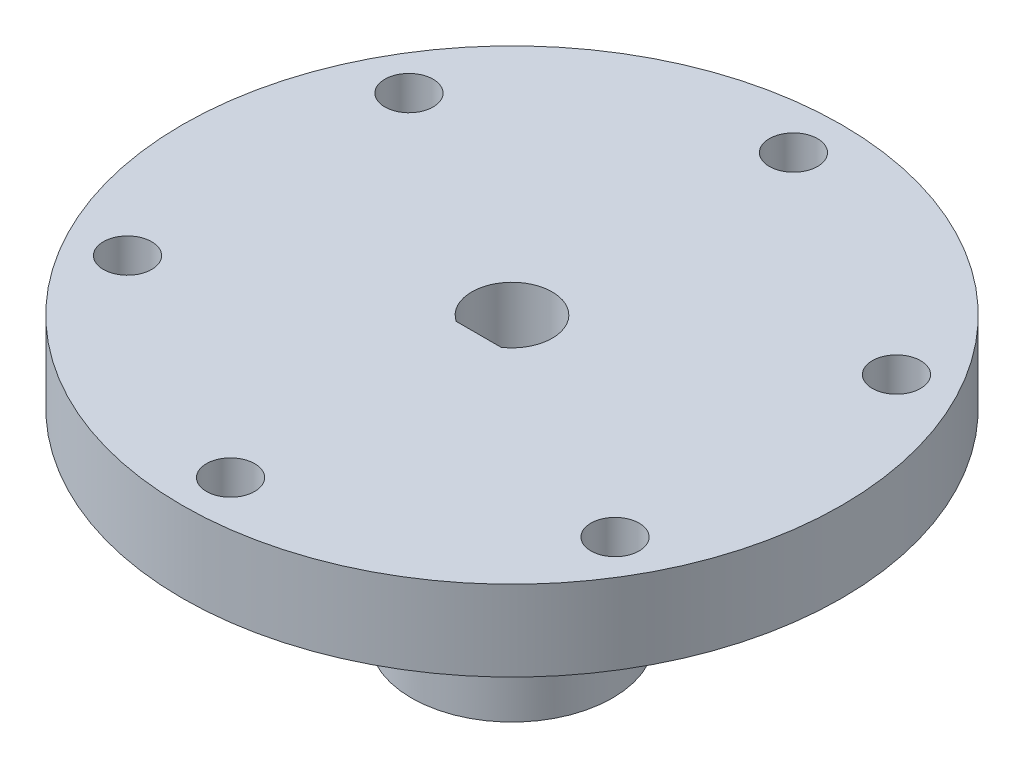
ISO-10303-21;
HEADER;
FILE_DESCRIPTION(('STEP AP214'),'2;1');
FILE_NAME('part.step','',(''),(''),'','','');
FILE_SCHEMA(('AUTOMOTIVE_DESIGN { 1 0 10303 214 1 1 1 1 }'));
ENDSEC;
DATA;
#1=APPLICATION_CONTEXT('core data for automotive mechanical design processes');
#2=APPLICATION_PROTOCOL_DEFINITION('international standard','automotive_design',2000,#1);
#3=PRODUCT_CONTEXT('',#1,'mechanical');
#4=PRODUCT('Part','Part','',(#3));
#5=PRODUCT_RELATED_PRODUCT_CATEGORY('part','',(#4));
#6=PRODUCT_DEFINITION_FORMATION('','',#4);
#7=PRODUCT_DEFINITION_CONTEXT('part definition',#1,'design');
#8=PRODUCT_DEFINITION('design','',#6,#7);
#9=PRODUCT_DEFINITION_SHAPE('','',#8);
#10=(LENGTH_UNIT() NAMED_UNIT(*) SI_UNIT(.MILLI.,.METRE.));
#11=(NAMED_UNIT(*) PLANE_ANGLE_UNIT() SI_UNIT($,.RADIAN.));
#12=(NAMED_UNIT(*) SI_UNIT($,.STERADIAN.) SOLID_ANGLE_UNIT());
#13=UNCERTAINTY_MEASURE_WITH_UNIT(LENGTH_MEASURE(1.E-05),#10,'distance_accuracy_value','');
#14=(GEOMETRIC_REPRESENTATION_CONTEXT(3) GLOBAL_UNCERTAINTY_ASSIGNED_CONTEXT((#13)) GLOBAL_UNIT_ASSIGNED_CONTEXT((#10,
#11,#12)) REPRESENTATION_CONTEXT('',''));
#15=CARTESIAN_POINT('',(0.,0.,0.));
#16=DIRECTION('',(0.,0.,1.));
#17=DIRECTION('',(1.,0.,0.));
#18=AXIS2_PLACEMENT_3D('',#15,#16,#17);
#19=CARTESIAN_POINT('',(0.,35.,0.));
#20=DIRECTION('',(0.,-1.,0.));
#21=DIRECTION('',(0.,0.,-1.));
#22=AXIS2_PLACEMENT_3D('',#19,#20,#21);
#23=CYLINDRICAL_SURFACE('',#22,41.);
#24=CARTESIAN_POINT('',(0.,35.,0.));
#25=DIRECTION('',(0.,1.,0.));
#26=DIRECTION('',(0.,0.,1.));
#27=AXIS2_PLACEMENT_3D('',#24,#25,#26);
#28=CIRCLE('',#27,41.);
#29=CARTESIAN_POINT('',(0.,35.,41.));
#30=VERTEX_POINT('',#29);
#31=EDGE_CURVE('E70',#30,#30,#28,.T.);
#32=ORIENTED_EDGE('',*,*,#31,.F.);
#33=EDGE_LOOP('',(#32));
#34=FACE_BOUND('',#33,.T.);
#35=CARTESIAN_POINT('',(0.,25.,0.));
#36=DIRECTION('',(0.,-1.,0.));
#37=DIRECTION('',(0.,0.,-1.));
#38=AXIS2_PLACEMENT_3D('',#35,#36,#37);
#39=CIRCLE('',#38,41.);
#40=CARTESIAN_POINT('',(0.,25.,-41.));
#41=VERTEX_POINT('',#40);
#42=EDGE_CURVE('E184',#41,#41,#39,.T.);
#43=ORIENTED_EDGE('',*,*,#42,.F.);
#44=EDGE_LOOP('',(#43));
#45=FACE_BOUND('',#44,.T.);
#46=ADVANCED_FACE('F38',(#34,#45),#23,.T.);
#47=CARTESIAN_POINT('',(30.3108891324554,0.,-17.5));
#48=DIRECTION('',(0.,1.,0.));
#49=DIRECTION('',(0.,0.,1.));
#50=AXIS2_PLACEMENT_3D('',#47,#48,#49);
#51=CYLINDRICAL_SURFACE('',#50,3.00000000000009);
#52=CARTESIAN_POINT('',(30.3108891324554,35.,-17.5));
#53=DIRECTION('',(0.,1.,0.));
#54=DIRECTION('',(0.,0.,1.));
#55=AXIS2_PLACEMENT_3D('',#52,#53,#54);
#56=CIRCLE('',#55,3.00000000000009);
#57=CARTESIAN_POINT('',(30.3108891324554,35.,-14.4999999999999));
#58=VERTEX_POINT('',#57);
#59=EDGE_CURVE('E95',#58,#58,#56,.T.);
#60=ORIENTED_EDGE('',*,*,#59,.T.);
#61=EDGE_LOOP('',(#60));
#62=FACE_BOUND('',#61,.T.);
#63=CARTESIAN_POINT('',(30.3108891324554,25.,-17.5));
#64=DIRECTION('',(0.,-1.,0.));
#65=DIRECTION('',(0.,0.,-1.));
#66=AXIS2_PLACEMENT_3D('',#63,#64,#65);
#67=CIRCLE('',#66,3.00000000000009);
#68=CARTESIAN_POINT('',(30.3108891324554,25.,-20.5000000000001));
#69=VERTEX_POINT('',#68);
#70=EDGE_CURVE('E166',#69,#69,#67,.F.);
#71=ORIENTED_EDGE('',*,*,#70,.F.);
#72=EDGE_LOOP('',(#71));
#73=FACE_BOUND('',#72,.T.);
#74=ADVANCED_FACE('F127',(#62,#73),#51,.F.);
#75=CARTESIAN_POINT('',(30.3108891324554,0.,17.5));
#76=DIRECTION('',(0.,1.,0.));
#77=DIRECTION('',(0.,0.,1.));
#78=AXIS2_PLACEMENT_3D('',#75,#76,#77);
#79=CYLINDRICAL_SURFACE('',#78,3.00000000000017);
#80=CARTESIAN_POINT('',(30.3108891324554,35.,17.5));
#81=DIRECTION('',(0.,1.,0.));
#82=DIRECTION('',(0.,0.,1.));
#83=AXIS2_PLACEMENT_3D('',#80,#81,#82);
#84=CIRCLE('',#83,3.00000000000017);
#85=CARTESIAN_POINT('',(30.3108891324554,35.,20.5000000000002));
#86=VERTEX_POINT('',#85);
#87=EDGE_CURVE('E101',#86,#86,#84,.T.);
#88=ORIENTED_EDGE('',*,*,#87,.T.);
#89=EDGE_LOOP('',(#88));
#90=FACE_BOUND('',#89,.T.);
#91=CARTESIAN_POINT('',(30.3108891324554,25.,17.5));
#92=DIRECTION('',(0.,-1.,0.));
#93=DIRECTION('',(0.,0.,-1.));
#94=AXIS2_PLACEMENT_3D('',#91,#92,#93);
#95=CIRCLE('',#94,3.00000000000017);
#96=CARTESIAN_POINT('',(30.3108891324554,25.,14.4999999999998));
#97=VERTEX_POINT('',#96);
#98=EDGE_CURVE('E169',#97,#97,#95,.F.);
#99=ORIENTED_EDGE('',*,*,#98,.F.);
#100=EDGE_LOOP('',(#99));
#101=FACE_BOUND('',#100,.T.);
#102=ADVANCED_FACE('F133',(#90,#101),#79,.F.);
#103=CARTESIAN_POINT('',(0.,0.,35.));
#104=DIRECTION('',(0.,1.,0.));
#105=DIRECTION('',(0.,0.,1.));
#106=AXIS2_PLACEMENT_3D('',#103,#104,#105);
#107=CYLINDRICAL_SURFACE('',#106,3.00000000000024);
#108=CARTESIAN_POINT('',(0.,35.,35.));
#109=DIRECTION('',(0.,1.,0.));
#110=DIRECTION('',(0.,0.,1.));
#111=AXIS2_PLACEMENT_3D('',#108,#109,#110);
#112=CIRCLE('',#111,3.00000000000024);
#113=CARTESIAN_POINT('',(0.,35.,38.0000000000002));
#114=VERTEX_POINT('',#113);
#115=EDGE_CURVE('E104',#114,#114,#112,.T.);
#116=ORIENTED_EDGE('',*,*,#115,.T.);
#117=EDGE_LOOP('',(#116));
#118=FACE_BOUND('',#117,.T.);
#119=CARTESIAN_POINT('',(0.,25.,35.));
#120=DIRECTION('',(0.,-1.,0.));
#121=DIRECTION('',(0.,0.,-1.));
#122=AXIS2_PLACEMENT_3D('',#119,#120,#121);
#123=CIRCLE('',#122,3.00000000000024);
#124=CARTESIAN_POINT('',(0.,25.,31.9999999999998));
#125=VERTEX_POINT('',#124);
#126=EDGE_CURVE('E173',#125,#125,#123,.F.);
#127=ORIENTED_EDGE('',*,*,#126,.F.);
#128=EDGE_LOOP('',(#127));
#129=FACE_BOUND('',#128,.T.);
#130=ADVANCED_FACE('F210',(#118,#129),#107,.F.);
#131=CARTESIAN_POINT('',(-30.3108891324554,0.,17.5));
#132=DIRECTION('',(0.,1.,0.));
#133=DIRECTION('',(0.,0.,1.));
#134=AXIS2_PLACEMENT_3D('',#131,#132,#133);
#135=CYLINDRICAL_SURFACE('',#134,3.00000000000033);
#136=CARTESIAN_POINT('',(-30.3108891324554,35.,17.5));
#137=DIRECTION('',(0.,1.,0.));
#138=DIRECTION('',(0.,0.,1.));
#139=AXIS2_PLACEMENT_3D('',#136,#137,#138);
#140=CIRCLE('',#139,3.00000000000033);
#141=CARTESIAN_POINT('',(-30.3108891324554,35.,20.5000000000003));
#142=VERTEX_POINT('',#141);
#143=EDGE_CURVE('E98',#142,#142,#140,.T.);
#144=ORIENTED_EDGE('',*,*,#143,.T.);
#145=EDGE_LOOP('',(#144));
#146=FACE_BOUND('',#145,.T.);
#147=CARTESIAN_POINT('',(-30.3108891324554,25.,17.5));
#148=DIRECTION('',(0.,-1.,0.));
#149=DIRECTION('',(0.,0.,-1.));
#150=AXIS2_PLACEMENT_3D('',#147,#148,#149);
#151=CIRCLE('',#150,3.00000000000033);
#152=CARTESIAN_POINT('',(-30.3108891324554,25.,14.4999999999997));
#153=VERTEX_POINT('',#152);
#154=EDGE_CURVE('E178',#153,#153,#151,.F.);
#155=ORIENTED_EDGE('',*,*,#154,.F.);
#156=EDGE_LOOP('',(#155));
#157=FACE_BOUND('',#156,.T.);
#158=ADVANCED_FACE('F216',(#146,#157),#135,.F.);
#159=CARTESIAN_POINT('',(-30.3108891324554,0.,-17.5));
#160=DIRECTION('',(0.,1.,0.));
#161=DIRECTION('',(0.,0.,1.));
#162=AXIS2_PLACEMENT_3D('',#159,#160,#161);
#163=CYLINDRICAL_SURFACE('',#162,3.00000000000042);
#164=CARTESIAN_POINT('',(-30.3108891324554,35.,-17.5));
#165=DIRECTION('',(0.,1.,0.));
#166=DIRECTION('',(0.,0.,1.));
#167=AXIS2_PLACEMENT_3D('',#164,#165,#166);
#168=CIRCLE('',#167,3.00000000000042);
#169=CARTESIAN_POINT('',(-30.3108891324554,35.,-14.4999999999996));
#170=VERTEX_POINT('',#169);
#171=EDGE_CURVE('E78',#170,#170,#168,.T.);
#172=ORIENTED_EDGE('',*,*,#171,.T.);
#173=EDGE_LOOP('',(#172));
#174=FACE_BOUND('',#173,.T.);
#175=CARTESIAN_POINT('',(-30.3108891324554,25.,-17.5));
#176=DIRECTION('',(0.,-1.,0.));
#177=DIRECTION('',(0.,0.,-1.));
#178=AXIS2_PLACEMENT_3D('',#175,#176,#177);
#179=CIRCLE('',#178,3.00000000000042);
#180=CARTESIAN_POINT('',(-30.3108891324554,25.,-20.5000000000004));
#181=VERTEX_POINT('',#180);
#182=EDGE_CURVE('E181',#181,#181,#179,.F.);
#183=ORIENTED_EDGE('',*,*,#182,.F.);
#184=EDGE_LOOP('',(#183));
#185=FACE_BOUND('',#184,.T.);
#186=ADVANCED_FACE('F121',(#174,#185),#163,.F.);
#187=CARTESIAN_POINT('',(0.,0.,-35.));
#188=DIRECTION('',(0.,1.,0.));
#189=DIRECTION('',(0.,0.,1.));
#190=AXIS2_PLACEMENT_3D('',#187,#188,#189);
#191=CYLINDRICAL_SURFACE('',#190,3.);
#192=CARTESIAN_POINT('',(0.,35.,-35.));
#193=DIRECTION('',(0.,1.,0.));
#194=DIRECTION('',(0.,0.,1.));
#195=AXIS2_PLACEMENT_3D('',#192,#193,#194);
#196=CIRCLE('',#195,3.);
#197=CARTESIAN_POINT('',(0.,35.,-32.));
#198=VERTEX_POINT('',#197);
#199=EDGE_CURVE('E71',#198,#198,#196,.T.);
#200=ORIENTED_EDGE('',*,*,#199,.T.);
#201=EDGE_LOOP('',(#200));
#202=FACE_BOUND('',#201,.T.);
#203=CARTESIAN_POINT('',(0.,25.,-35.));
#204=DIRECTION('',(0.,-1.,0.));
#205=DIRECTION('',(0.,0.,-1.));
#206=AXIS2_PLACEMENT_3D('',#203,#204,#205);
#207=CIRCLE('',#206,3.);
#208=CARTESIAN_POINT('',(0.,25.,-38.));
#209=VERTEX_POINT('',#208);
#210=EDGE_CURVE('E43',#209,#209,#207,.F.);
#211=ORIENTED_EDGE('',*,*,#210,.F.);
#212=EDGE_LOOP('',(#211));
#213=FACE_BOUND('',#212,.T.);
#214=ADVANCED_FACE('F114',(#202,#213),#191,.F.);
#215=CARTESIAN_POINT('',(0.,0.,0.));
#216=DIRECTION('',(0.,1.,0.));
#217=DIRECTION('',(0.,0.,1.));
#218=AXIS2_PLACEMENT_3D('',#215,#216,#217);
#219=PLANE('',#218);
#220=CARTESIAN_POINT('',(0.,0.,0.));
#221=DIRECTION('',(0.,1.,0.));
#222=DIRECTION('',(0.,0.,1.));
#223=AXIS2_PLACEMENT_3D('',#220,#221,#222);
#224=CIRCLE('',#223,12.5);
#225=CARTESIAN_POINT('',(0.,0.,12.5));
#226=VERTEX_POINT('',#225);
#227=EDGE_CURVE('E11',#226,#226,#224,.T.);
#228=ORIENTED_EDGE('',*,*,#227,.F.);
#229=EDGE_LOOP('',(#228));
#230=FACE_BOUND('',#229,.T.);
#231=CARTESIAN_POINT('',(0.,0.,0.));
#232=DIRECTION('',(0.,1.,0.));
#233=DIRECTION('',(0.,0.,1.));
#234=AXIS2_PLACEMENT_3D('',#231,#232,#233);
#235=CIRCLE('',#234,5.);
#236=CARTESIAN_POINT('',(2.78881695347687,0.,4.15));
#237=VERTEX_POINT('',#236);
#238=CARTESIAN_POINT('',(-2.78881695347687,0.,4.15));
#239=VERTEX_POINT('',#238);
#240=EDGE_CURVE('E48',#237,#239,#235,.T.);
#241=ORIENTED_EDGE('',*,*,#240,.T.);
#242=DIRECTION('',(1.,0.,0.));
#243=VECTOR('',#242,1.);
#244=CARTESIAN_POINT('',(0.,0.,4.15));
#245=LINE('',#244,#243);
#246=EDGE_CURVE('E81',#239,#237,#245,.T.);
#247=ORIENTED_EDGE('',*,*,#246,.T.);
#248=EDGE_LOOP('',(#241,#247));
#249=FACE_BOUND('',#248,.T.);
#250=ADVANCED_FACE('F112',(#230,#249),#219,.F.);
#251=CARTESIAN_POINT('',(0.,15.,0.));
#252=DIRECTION('',(0.,-1.,0.));
#253=DIRECTION('',(0.,0.,-1.));
#254=AXIS2_PLACEMENT_3D('',#251,#252,#253);
#255=CYLINDRICAL_SURFACE('',#254,12.5);
#256=CARTESIAN_POINT('',(-1.5,9.,12.4096736459909));
#257=CARTESIAN_POINT('',(-1.49999641586388,9.08392957059518,12.4096748089167));
#258=CARTESIAN_POINT('',(-1.49293206748169,9.1679122600607,12.4105342894214));
#259=CARTESIAN_POINT('',(-1.46486159354819,9.33354230601578,12.4138782255216));
#260=CARTESIAN_POINT('',(-1.44384072619508,9.41518709784051,12.4163643992983));
#261=CARTESIAN_POINT('',(-1.38848417307918,9.5737192027569,12.4226761552619));
#262=CARTESIAN_POINT('',(-1.35415731394874,9.65060963056811,12.426500849368));
#263=CARTESIAN_POINT('',(-1.27318168778971,9.79752357105048,12.4350576249844));
#264=CARTESIAN_POINT('',(-1.22653510106008,9.86754829578398,12.4397895458966));
#265=CARTESIAN_POINT('',(-1.1219857196502,9.99911988580508,12.4496550027324));
#266=CARTESIAN_POINT('',(-1.06403198625323,10.0606261471743,12.4547902908254));
#267=CARTESIAN_POINT('',(-0.938622932174397,10.1730643590809,12.4648680792729));
#268=CARTESIAN_POINT('',(-0.871167147527071,10.2239957929709,12.4698105701984));
#269=CARTESIAN_POINT('',(-0.728414784233991,10.3139832664681,12.4789637011531));
#270=CARTESIAN_POINT('',(-0.653094976924497,10.3530027078698,12.4831720690333));
#271=CARTESIAN_POINT('',(-0.496912883636391,10.4178242301924,12.4903635621621));
#272=CARTESIAN_POINT('',(-0.416050788042773,10.4436267648739,12.4933467294733));
#273=CARTESIAN_POINT('',(-0.251493928492543,10.4811611280517,12.4977393662263));
#274=CARTESIAN_POINT('',(-0.167814735521691,10.4929603267229,12.4991563682204));
#275=CARTESIAN_POINT('',(0.000347248334280875,10.5023617996553,12.5002827183051));
#276=CARTESIAN_POINT('',(0.0848300098341681,10.4999645910791,12.4999921286017));
#277=CARTESIAN_POINT('',(0.251742833758763,10.4810954390743,12.4977421462633));
#278=CARTESIAN_POINT('',(0.334181218784105,10.4646959475138,12.4957913442169));
#279=CARTESIAN_POINT('',(0.495127185045587,10.418400924142,12.490449821119));
#280=CARTESIAN_POINT('',(0.5736346965213,10.3885051529092,12.4870590745233));
#281=CARTESIAN_POINT('',(0.724715561629686,10.3159886355467,12.4792038952277));
#282=CARTESIAN_POINT('',(0.79727364863769,10.2733363819968,12.4747368094346));
#283=CARTESIAN_POINT('',(0.93422946009939,10.1765405505219,12.465229048358));
#284=CARTESIAN_POINT('',(0.998626839383444,10.1223964867922,12.4601883488298));
#285=CARTESIAN_POINT('',(1.11785860561525,10.0037478252298,12.4500603372648));
#286=CARTESIAN_POINT('',(1.17263019439189,9.93918010931325,12.4449729316271));
#287=CARTESIAN_POINT('',(1.27056795912578,9.80173424316025,12.4353563023037));
#288=CARTESIAN_POINT('',(1.31373410365263,9.72885607041776,12.4308270801297));
#289=CARTESIAN_POINT('',(1.38723839179325,9.57680375492631,12.4228396027608));
#290=CARTESIAN_POINT('',(1.41757175578821,9.49762727937105,12.4193817467283));
#291=CARTESIAN_POINT('',(1.46449505016189,9.33525382024941,12.4139364153306));
#292=CARTESIAN_POINT('',(1.48108558929275,9.25205701494035,12.4119488748366));
#293=CARTESIAN_POINT('',(1.49996964356083,9.08455845181166,12.4096810007818));
#294=CARTESIAN_POINT('',(1.50235142135386,9.00026678205943,12.4093901280317));
#295=CARTESIAN_POINT('',(1.49298299027801,8.83248560957853,12.4105206650573));
#296=CARTESIAN_POINT('',(1.48123305845624,8.74899609115631,12.411942041265));
#297=CARTESIAN_POINT('',(1.44400895971009,8.58545210820101,12.4163273137489));
#298=CARTESIAN_POINT('',(1.41857731249469,8.50538782659534,12.4192864301079));
#299=CARTESIAN_POINT('',(1.35475538396312,8.35066035851202,12.4264098926624));
#300=CARTESIAN_POINT('',(1.31636468129306,8.27599734774847,12.4305742780457));
#301=CARTESIAN_POINT('',(1.22749651360805,8.13379185251269,12.4396643656649));
#302=CARTESIAN_POINT('',(1.17696103570738,8.06628585655934,12.4445936804928));
#303=CARTESIAN_POINT('',(1.06532008918354,7.9406824434941,12.4546467770184));
#304=CARTESIAN_POINT('',(1.0042142422181,7.88258536329706,12.4597705656719));
#305=CARTESIAN_POINT('',(0.872782136333862,7.77714012638254,12.4696675472455));
#306=CARTESIAN_POINT('',(0.802409249708918,7.72984987674429,12.4744387628015));
#307=CARTESIAN_POINT('',(0.65466821470529,7.64776089533545,12.483063621558));
#308=CARTESIAN_POINT('',(0.577300197822209,7.61296192881278,12.4869172820019));
#309=CARTESIAN_POINT('',(0.417959622359993,7.5569394975621,12.4932640215257));
#310=CARTESIAN_POINT('',(0.335999085323591,7.53568224005787,12.4957604851314));
#311=CARTESIAN_POINT('',(0.169640292495739,7.50723662820892,12.4991255682254));
#312=CARTESIAN_POINT('',(0.0852421377306311,7.50004769165343,12.4999942550783));
#313=CARTESIAN_POINT('',(-0.0830300031278289,7.49995307794384,12.5000056524324));
#314=CARTESIAN_POINT('',(-0.166903952329435,7.50695798165839,12.4991591682624));
#315=CARTESIAN_POINT('',(-0.332273612398117,7.53486322745123,12.4958567701035));
#316=CARTESIAN_POINT('',(-0.413769324044743,7.55576356497476,12.4934008566421));
#317=CARTESIAN_POINT('',(-0.572059777991807,7.61083900756579,12.4871544009745));
#318=CARTESIAN_POINT('',(-0.648855904373998,7.64501018222724,12.4833642539575));
#319=CARTESIAN_POINT('',(-0.795637705262655,7.7256480347922,12.474869622158));
#320=CARTESIAN_POINT('',(-0.86562332464685,7.77211481220143,12.4701651299761));
#321=CARTESIAN_POINT('',(-0.997254742124291,7.87635684100312,12.4603319681132));
#322=CARTESIAN_POINT('',(-1.0588476339384,7.93419867766288,12.4552009088046));
#323=CARTESIAN_POINT('',(-1.17148865356204,8.05941151857621,12.4451123432295));
#324=CARTESIAN_POINT('',(-1.22253427406543,8.12678478225065,12.4401548784622));
#325=CARTESIAN_POINT('',(-1.31278537364373,8.26942146808524,12.4309559603764));
#326=CARTESIAN_POINT('',(-1.35194799100155,8.34471216413647,12.4267171228205));
#327=CARTESIAN_POINT('',(-1.41701902911872,8.50080887687538,12.419466118837));
#328=CARTESIAN_POINT('',(-1.44294198213015,8.58160873559888,12.4164526081981));
#329=CARTESIAN_POINT('',(-1.4745350503682,8.71902976955269,12.4127313618494));
#330=CARTESIAN_POINT('',(-1.48407082470974,8.77478137597994,12.4115903654975));
#331=CARTESIAN_POINT('',(-1.49680448454756,8.88701396606712,12.4100611186528));
#332=CARTESIAN_POINT('',(-1.50000241299709,8.94349494478129,12.4096728630583));
#333=CARTESIAN_POINT('',(-1.5,9.,12.4096736459909));
#334=B_SPLINE_CURVE_WITH_KNOTS('',3,(#256,#257,#258,#259,#260,#261,#262,#263,#264,#265,#266,
#267,#268,#269,#270,#271,#272,#273,#274,#275,#276,#277,#278,#279,#280,#281,#282,#283,#284,#285,
#286,#287,#288,#289,#290,#291,#292,#293,#294,#295,#296,#297,#298,#299,#300,#301,#302,#303,#304,
#305,#306,#307,#308,#309,#310,#311,#312,#313,#314,#315,#316,#317,#318,#319,#320,#321,#322,#323,
#324,#325,#326,#327,#328,#329,#330,#331,#332,#333),.UNSPECIFIED.,.T.,.F.,(4,2,2,2,2,2,2,2,2,2,2,
2,2,2,2,2,2,2,2,2,2,2,2,2,2,2,2,2,2,2,2,2,2,2,2,2,2,2,4),(0.,0.25158230660961,0.503430774819311,
0.755112462522261,1.0067496383611,1.25954776660377,1.5123582427361,1.76593780876769,
2.01950866836447,2.27185458608052,2.52419131111312,2.77523023079344,3.02627360403335,
3.27794222677635,3.52962149067918,3.78288622204422,4.03615163930559,4.28951130338294,
4.54285974404081,4.79463277043148,5.0464008609825,5.29739099483104,5.54838929022027,
5.80061125155308,6.05284224246467,6.30639464647639,6.55994228515918,6.81285470170487,
7.06575665136928,7.31707030939076,7.56838388503437,7.81962308616498,8.07086432058376,
8.32362252061905,8.57644073759112,8.83016031080822,9.08360079205963,9.25297814464872,
9.42235434931908),.UNSPECIFIED.);
#335=CARTESIAN_POINT('',(-1.5,9.,12.4096736459909));
#336=VERTEX_POINT('',#335);
#337=EDGE_CURVE('E84',#336,#336,#334,.T.);
#338=ORIENTED_EDGE('',*,*,#337,.T.);
#339=EDGE_LOOP('',(#338));
#340=FACE_BOUND('',#339,.T.);
#341=ORIENTED_EDGE('',*,*,#227,.T.);
#342=EDGE_LOOP('',(#341));
#343=FACE_BOUND('',#342,.T.);
#344=CARTESIAN_POINT('',(0.,25.,0.));
#345=DIRECTION('',(0.,-1.,0.));
#346=DIRECTION('',(0.,0.,-1.));
#347=AXIS2_PLACEMENT_3D('',#344,#345,#346);
#348=CIRCLE('',#347,12.5);
#349=CARTESIAN_POINT('',(0.,25.,-12.5));
#350=VERTEX_POINT('',#349);
#351=EDGE_CURVE('E187',#350,#350,#348,.T.);
#352=ORIENTED_EDGE('',*,*,#351,.T.);
#353=EDGE_LOOP('',(#352));
#354=FACE_BOUND('',#353,.T.);
#355=ADVANCED_FACE('F40',(#340,#343,#354),#255,.T.);
#356=CARTESIAN_POINT('',(0.,15.,0.));
#357=DIRECTION('',(0.,-1.,0.));
#358=DIRECTION('',(0.,0.,-1.));
#359=AXIS2_PLACEMENT_3D('',#356,#357,#358);
#360=CYLINDRICAL_SURFACE('',#359,5.);
#361=DIRECTION('',(0.,-1.,0.));
#362=VECTOR('',#361,1.);
#363=CARTESIAN_POINT('',(2.78881695347687,35.,4.15));
#364=LINE('',#363,#362);
#365=CARTESIAN_POINT('',(2.78881695347687,35.,4.15));
#366=VERTEX_POINT('',#365);
#367=EDGE_CURVE('E73',#366,#237,#364,.T.);
#368=ORIENTED_EDGE('',*,*,#367,.F.);
#369=CARTESIAN_POINT('',(0.,35.,0.));
#370=DIRECTION('',(0.,1.,0.));
#371=DIRECTION('',(0.,0.,1.));
#372=AXIS2_PLACEMENT_3D('',#369,#370,#371);
#373=CIRCLE('',#372,5.);
#374=CARTESIAN_POINT('',(-2.78881695347687,35.,4.15));
#375=VERTEX_POINT('',#374);
#376=EDGE_CURVE('E66',#366,#375,#373,.T.);
#377=ORIENTED_EDGE('',*,*,#376,.T.);
#378=DIRECTION('',(0.,-1.,0.));
#379=VECTOR('',#378,1.);
#380=CARTESIAN_POINT('',(-2.78881695347687,35.,4.15));
#381=LINE('',#380,#379);
#382=EDGE_CURVE('E55',#375,#239,#381,.T.);
#383=ORIENTED_EDGE('',*,*,#382,.T.);
#384=ORIENTED_EDGE('',*,*,#240,.F.);
#385=EDGE_LOOP('',(#368,#377,#383,#384));
#386=FACE_BOUND('',#385,.T.);
#387=ADVANCED_FACE('F74',(#386),#360,.F.);
#388=CARTESIAN_POINT('',(0.,35.,0.));
#389=DIRECTION('',(0.,1.,0.));
#390=DIRECTION('',(0.,0.,1.));
#391=AXIS2_PLACEMENT_3D('',#388,#389,#390);
#392=PLANE('',#391);
#393=ORIENTED_EDGE('',*,*,#199,.F.);
#394=EDGE_LOOP('',(#393));
#395=FACE_BOUND('',#394,.T.);
#396=ORIENTED_EDGE('',*,*,#171,.F.);
#397=EDGE_LOOP('',(#396));
#398=FACE_BOUND('',#397,.T.);
#399=ORIENTED_EDGE('',*,*,#143,.F.);
#400=EDGE_LOOP('',(#399));
#401=FACE_BOUND('',#400,.T.);
#402=ORIENTED_EDGE('',*,*,#115,.F.);
#403=EDGE_LOOP('',(#402));
#404=FACE_BOUND('',#403,.T.);
#405=ORIENTED_EDGE('',*,*,#87,.F.);
#406=EDGE_LOOP('',(#405));
#407=FACE_BOUND('',#406,.T.);
#408=ORIENTED_EDGE('',*,*,#59,.F.);
#409=EDGE_LOOP('',(#408));
#410=FACE_BOUND('',#409,.T.);
#411=ORIENTED_EDGE('',*,*,#31,.T.);
#412=EDGE_LOOP('',(#411));
#413=FACE_BOUND('',#412,.T.);
#414=ORIENTED_EDGE('',*,*,#376,.F.);
#415=DIRECTION('',(1.,0.,0.));
#416=VECTOR('',#415,1.);
#417=CARTESIAN_POINT('',(0.,35.,4.15));
#418=LINE('',#417,#416);
#419=EDGE_CURVE('E69',#375,#366,#418,.T.);
#420=ORIENTED_EDGE('',*,*,#419,.F.);
#421=EDGE_LOOP('',(#414,#420));
#422=FACE_BOUND('',#421,.T.);
#423=ADVANCED_FACE('F67',(#395,#398,#401,#404,#407,#410,#413,#422),#392,.T.);
#424=CARTESIAN_POINT('',(0.,35.,4.15));
#425=DIRECTION('',(0.,0.,-1.));
#426=DIRECTION('',(-1.,0.,0.));
#427=AXIS2_PLACEMENT_3D('',#424,#425,#426);
#428=PLANE('',#427);
#429=CARTESIAN_POINT('',(0.,9.,4.15));
#430=DIRECTION('',(0.,0.,-1.));
#431=DIRECTION('',(-1.,0.,0.));
#432=AXIS2_PLACEMENT_3D('',#429,#430,#431);
#433=CIRCLE('',#432,1.5);
#434=CARTESIAN_POINT('',(-1.5,9.,4.15));
#435=VERTEX_POINT('',#434);
#436=EDGE_CURVE('E168',#435,#435,#433,.T.);
#437=ORIENTED_EDGE('',*,*,#436,.F.);
#438=EDGE_LOOP('',(#437));
#439=FACE_BOUND('',#438,.T.);
#440=ORIENTED_EDGE('',*,*,#246,.F.);
#441=ORIENTED_EDGE('',*,*,#382,.F.);
#442=ORIENTED_EDGE('',*,*,#419,.T.);
#443=ORIENTED_EDGE('',*,*,#367,.T.);
#444=EDGE_LOOP('',(#440,#441,#442,#443));
#445=FACE_BOUND('',#444,.T.);
#446=ADVANCED_FACE('F80',(#439,#445),#428,.T.);
#447=CARTESIAN_POINT('',(0.,9.,41.));
#448=DIRECTION('',(0.,0.,-1.));
#449=DIRECTION('',(-1.,0.,0.));
#450=AXIS2_PLACEMENT_3D('',#447,#448,#449);
#451=CYLINDRICAL_SURFACE('',#450,1.5);
#452=ORIENTED_EDGE('',*,*,#436,.T.);
#453=EDGE_LOOP('',(#452));
#454=FACE_BOUND('',#453,.T.);
#455=ORIENTED_EDGE('',*,*,#337,.F.);
#456=EDGE_LOOP('',(#455));
#457=FACE_BOUND('',#456,.T.);
#458=ADVANCED_FACE('F148',(#454,#457),#451,.F.);
#459=CARTESIAN_POINT('',(0.,25.,0.));
#460=DIRECTION('',(0.,-1.,0.));
#461=DIRECTION('',(0.,0.,-1.));
#462=AXIS2_PLACEMENT_3D('',#459,#460,#461);
#463=PLANE('',#462);
#464=ORIENTED_EDGE('',*,*,#351,.F.);
#465=EDGE_LOOP('',(#464));
#466=FACE_BOUND('',#465,.T.);
#467=ORIENTED_EDGE('',*,*,#42,.T.);
#468=EDGE_LOOP('',(#467));
#469=FACE_BOUND('',#468,.T.);
#470=ORIENTED_EDGE('',*,*,#210,.T.);
#471=EDGE_LOOP('',(#470));
#472=FACE_BOUND('',#471,.T.);
#473=ORIENTED_EDGE('',*,*,#182,.T.);
#474=EDGE_LOOP('',(#473));
#475=FACE_BOUND('',#474,.T.);
#476=ORIENTED_EDGE('',*,*,#154,.T.);
#477=EDGE_LOOP('',(#476));
#478=FACE_BOUND('',#477,.T.);
#479=ORIENTED_EDGE('',*,*,#126,.T.);
#480=EDGE_LOOP('',(#479));
#481=FACE_BOUND('',#480,.T.);
#482=ORIENTED_EDGE('',*,*,#98,.T.);
#483=EDGE_LOOP('',(#482));
#484=FACE_BOUND('',#483,.T.);
#485=ORIENTED_EDGE('',*,*,#70,.T.);
#486=EDGE_LOOP('',(#485));
#487=FACE_BOUND('',#486,.T.);
#488=ADVANCED_FACE('F192',(#466,#469,#472,#475,#478,#481,#484,#487),#463,.T.);
#489=CLOSED_SHELL('',(#46,#74,#102,#130,#158,#186,#214,#250,#355,#387,#423,#446,#458,#488));
#490=MANIFOLD_SOLID_BREP('B2',#489);
#491=ADVANCED_BREP_SHAPE_REPRESENTATION('',(#18,#490),#14);
#492=SHAPE_DEFINITION_REPRESENTATION(#9,#491);
ENDSEC;
END-ISO-10303-21;
